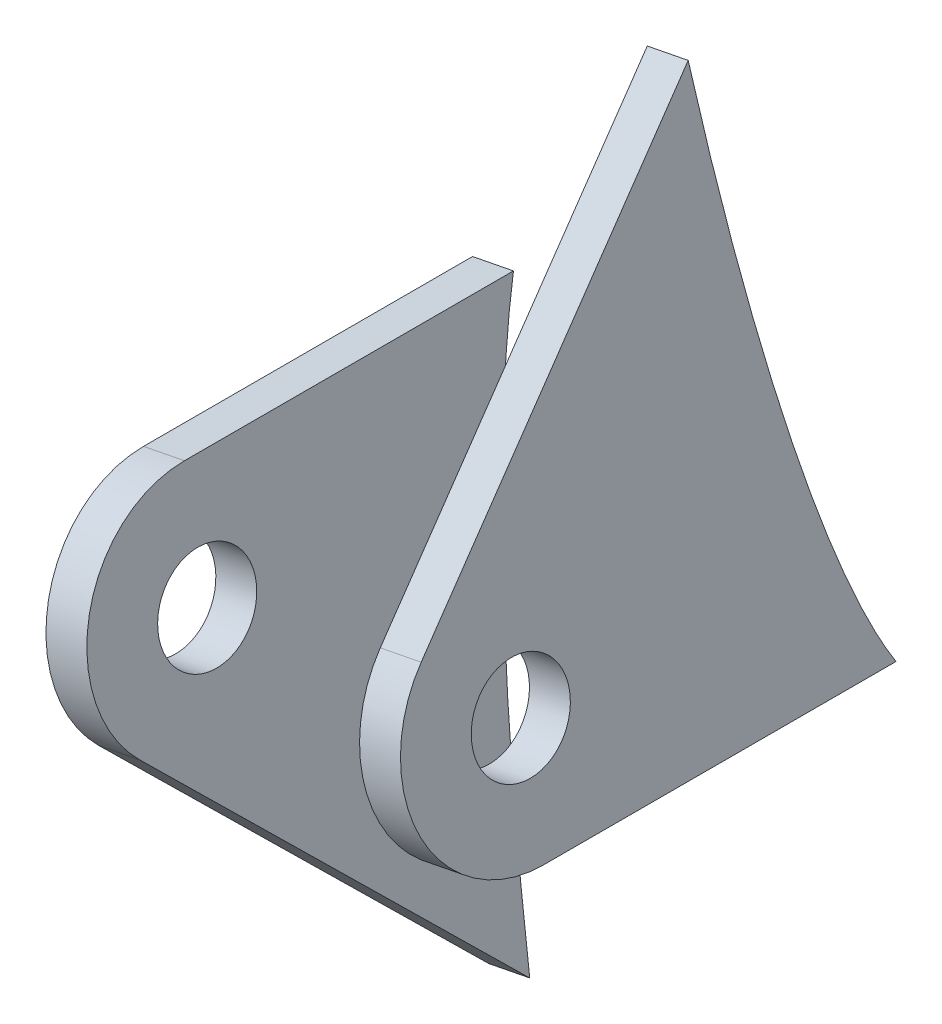
ISO-10303-21;
HEADER;
FILE_DESCRIPTION(('STEP AP214'),'2;1');
FILE_NAME('part.step','',(''),(''),'','','');
FILE_SCHEMA(('AUTOMOTIVE_DESIGN { 1 0 10303 214 1 1 1 1 }'));
ENDSEC;
DATA;
#1=APPLICATION_CONTEXT('core data for automotive mechanical design processes');
#2=APPLICATION_PROTOCOL_DEFINITION('international standard','automotive_design',2000,#1);
#3=PRODUCT_CONTEXT('',#1,'mechanical');
#4=PRODUCT('Part','Part','',(#3));
#5=PRODUCT_RELATED_PRODUCT_CATEGORY('part','',(#4));
#6=PRODUCT_DEFINITION_FORMATION('','',#4);
#7=PRODUCT_DEFINITION_CONTEXT('part definition',#1,'design');
#8=PRODUCT_DEFINITION('design','',#6,#7);
#9=PRODUCT_DEFINITION_SHAPE('','',#8);
#10=(LENGTH_UNIT() NAMED_UNIT(*) SI_UNIT(.MILLI.,.METRE.));
#11=(NAMED_UNIT(*) PLANE_ANGLE_UNIT() SI_UNIT($,.RADIAN.));
#12=(NAMED_UNIT(*) SI_UNIT($,.STERADIAN.) SOLID_ANGLE_UNIT());
#13=UNCERTAINTY_MEASURE_WITH_UNIT(LENGTH_MEASURE(1.E-05),#10,'distance_accuracy_value','');
#14=(GEOMETRIC_REPRESENTATION_CONTEXT(3) GLOBAL_UNCERTAINTY_ASSIGNED_CONTEXT((#13)) GLOBAL_UNIT_ASSIGNED_CONTEXT((#10,
#11,#12)) REPRESENTATION_CONTEXT('',''));
#15=CARTESIAN_POINT('',(0.,0.,0.));
#16=DIRECTION('',(0.,0.,1.));
#17=DIRECTION('',(1.,0.,0.));
#18=AXIS2_PLACEMENT_3D('',#15,#16,#17);
#19=CARTESIAN_POINT('',(1415.64044683684,-134.580184633639,404.672593211234));
#20=DIRECTION('',(0.135715180098194,-0.693960692822464,0.70710674350361));
#21=DIRECTION('',(0.,-0.713710064520569,-0.700441249357893));
#22=AXIS2_PLACEMENT_3D('',#19,#20,#21);
#23=PLANE('',#22);
#24=DIRECTION('',(0.136168267482668,-0.693871930706592,-0.707106743503606));
#25=VECTOR('',#24,1.);
#26=CARTESIAN_POINT('',(1418.5844842577,-134.003432775944,404.673572624839));
#27=LINE('',#26,#25);
#28=CARTESIAN_POINT('',(1411.69520051873,-98.8977455441605,440.448860654784));
#29=VERTEX_POINT('',#28);
#30=CARTESIAN_POINT('',(1416.22677221443,-121.989251808875,416.916910341118));
#31=VERTEX_POINT('',#30);
#32=EDGE_CURVE('E127',#29,#31,#27,.T.);
#33=ORIENTED_EDGE('',*,*,#32,.F.);
#34=DIRECTION('',(0.9813458069517,0.192250619231437,0.000326471201780524));
#35=VECTOR('',#34,1.);
#36=CARTESIAN_POINT('',(1408.75116309788,-99.4744974018548,440.447881241179));
#37=LINE('',#36,#35);
#38=CARTESIAN_POINT('',(1408.75116309788,-99.4744974018548,440.447881241179));
#39=VERTEX_POINT('',#38);
#40=EDGE_CURVE('E12',#39,#29,#37,.T.);
#41=ORIENTED_EDGE('',*,*,#40,.F.);
#42=DIRECTION('',(0.136168267482668,-0.693871930706592,-0.707106743503606));
#43=VECTOR('',#42,1.);
#44=CARTESIAN_POINT('',(1415.64044683684,-134.580184633639,404.672593211234));
#45=LINE('',#44,#43);
#46=CARTESIAN_POINT('',(1413.28273479358,-122.56600366657,416.915930927512));
#47=VERTEX_POINT('',#46);
#48=EDGE_CURVE('E105',#39,#47,#45,.T.);
#49=ORIENTED_EDGE('',*,*,#48,.T.);
#50=DIRECTION('',(0.9813458069517,0.192250619231437,0.000326471201780524));
#51=VECTOR('',#50,1.);
#52=CARTESIAN_POINT('',(1413.28273479358,-122.56600366657,416.915930927512));
#53=LINE('',#52,#51);
#54=EDGE_CURVE('E50',#47,#31,#53,.T.);
#55=ORIENTED_EDGE('',*,*,#54,.T.);
#56=EDGE_LOOP('',(#33,#41,#49,#55));
#57=FACE_BOUND('',#56,.T.);
#58=ADVANCED_FACE('F46',(#57),#23,.T.);
#59=CARTESIAN_POINT('',(1407.59758406704,-93.5758315128638,434.437473921398));
#60=DIRECTION('',(0.9813458069517,0.192250619231437,0.000326471201780524));
#61=DIRECTION('',(-0.192250629476805,0.981345859249313,0.));
#62=AXIS2_PLACEMENT_3D('',#59,#60,#61);
#63=CYLINDRICAL_SURFACE('',#62,8.50000000000007);
#64=CARTESIAN_POINT('',(1410.5416214879,-92.9990796551694,434.438453335004));
#65=DIRECTION('',(0.9813458069517,0.192250619231437,0.000326471201780365));
#66=DIRECTION('',(-0.192250629476804,0.981345859249313,0.));
#67=AXIS2_PLACEMENT_3D('',#64,#65,#66);
#68=CIRCLE('',#67,8.50000000000007);
#69=CARTESIAN_POINT('',(1408.90749113735,-84.6576398515503,434.438453335004));
#70=VERTEX_POINT('',#69);
#71=EDGE_CURVE('E133',#70,#29,#68,.T.);
#72=ORIENTED_EDGE('',*,*,#71,.F.);
#73=DIRECTION('',(0.9813458069517,0.192250619231437,0.000326471201780524));
#74=VECTOR('',#73,1.);
#75=CARTESIAN_POINT('',(1405.96345371649,-85.2343917092446,434.437473921398));
#76=LINE('',#75,#74);
#77=CARTESIAN_POINT('',(1405.96345371649,-85.2343917092446,434.437473921398));
#78=VERTEX_POINT('',#77);
#79=EDGE_CURVE('E56',#78,#70,#76,.T.);
#80=ORIENTED_EDGE('',*,*,#79,.F.);
#81=CARTESIAN_POINT('',(1407.59758406704,-93.5758315128638,434.437473921398));
#82=DIRECTION('',(0.9813458069517,0.192250619231437,0.000326471201780365));
#83=DIRECTION('',(-0.192250629476804,0.981345859249313,0.));
#84=AXIS2_PLACEMENT_3D('',#81,#82,#83);
#85=CIRCLE('',#84,8.50000000000007);
#86=EDGE_CURVE('E98',#78,#39,#85,.T.);
#87=ORIENTED_EDGE('',*,*,#86,.T.);
#88=ORIENTED_EDGE('',*,*,#40,.T.);
#89=EDGE_LOOP('',(#72,#80,#87,#88));
#90=FACE_BOUND('',#89,.T.);
#91=ADVANCED_FACE('F122',(#90),#63,.T.);
#92=CARTESIAN_POINT('',(1406.1024966919,-85.2071524853947,0.445140808783872));
#93=DIRECTION('',(0.192250629476805,-0.981345859249313,0.));
#94=DIRECTION('',(0.981345859249313,0.192250629476805,0.));
#95=AXIS2_PLACEMENT_3D('',#92,#93,#94);
#96=PLANE('',#95);
#97=DIRECTION('',(0.000320381162036681,6.27642940208991E-05,-0.999999946708276));
#98=VECTOR('',#97,1.);
#99=CARTESIAN_POINT('',(1409.04653411275,-84.6304006277004,0.446120222389214));
#100=LINE('',#99,#98);
#101=CARTESIAN_POINT('',(1408.91507180398,-84.6561547605223,410.777055209102));
#102=VERTEX_POINT('',#101);
#103=EDGE_CURVE('E102',#70,#102,#100,.T.);
#104=ORIENTED_EDGE('',*,*,#103,.T.);
#105=DIRECTION('',(0.9813458069517,0.192250619231437,0.000326471201780524));
#106=VECTOR('',#105,1.);
#107=CARTESIAN_POINT('',(1405.97103438312,-85.2329066182166,410.776075795496));
#108=LINE('',#107,#106);
#109=CARTESIAN_POINT('',(1405.97103438312,-85.2329066182166,410.776075795496));
#110=VERTEX_POINT('',#109);
#111=EDGE_CURVE('E100',#110,#102,#108,.T.);
#112=ORIENTED_EDGE('',*,*,#111,.F.);
#113=DIRECTION('',(0.000320381162036681,6.27642940208991E-05,-0.999999946708276));
#114=VECTOR('',#113,1.);
#115=CARTESIAN_POINT('',(1406.1024966919,-85.2071524853947,0.445140808783872));
#116=LINE('',#115,#114);
#117=EDGE_CURVE('E94',#78,#110,#116,.T.);
#118=ORIENTED_EDGE('',*,*,#117,.F.);
#119=ORIENTED_EDGE('',*,*,#79,.T.);
#120=EDGE_LOOP('',(#104,#112,#118,#119));
#121=FACE_BOUND('',#120,.T.);
#122=ADVANCED_FACE('F101',(#121),#96,.F.);
#123=CARTESIAN_POINT('',(1407.59758406704,-93.5758315128638,434.437473921398));
#124=DIRECTION('',(0.9813458069517,0.192250619231437,0.000326471201780524));
#125=DIRECTION('',(-0.192250629476805,0.981345859249313,0.));
#126=AXIS2_PLACEMENT_3D('',#123,#124,#125);
#127=CYLINDRICAL_SURFACE('',#126,3.50000000000004);
#128=CARTESIAN_POINT('',(1407.59758406704,-93.5758315128638,434.437473921398));
#129=DIRECTION('',(0.9813458069517,0.192250619231437,0.000326471201780365));
#130=DIRECTION('',(-0.192250629476804,0.981345859249313,0.));
#131=AXIS2_PLACEMENT_3D('',#128,#129,#130);
#132=CIRCLE('',#131,3.50000000000004);
#133=CARTESIAN_POINT('',(1406.92470686387,-90.1411210054912,434.437473921398));
#134=VERTEX_POINT('',#133);
#135=EDGE_CURVE('E107',#134,#134,#132,.T.);
#136=ORIENTED_EDGE('',*,*,#135,.F.);
#137=EDGE_LOOP('',(#136));
#138=FACE_BOUND('',#137,.T.);
#139=CARTESIAN_POINT('',(1410.5416214879,-92.9990796551695,434.438453335004));
#140=DIRECTION('',(0.9813458069517,0.192250619231437,0.000326471201780365));
#141=DIRECTION('',(-0.192250629476804,0.981345859249313,0.));
#142=AXIS2_PLACEMENT_3D('',#139,#140,#141);
#143=CIRCLE('',#142,3.50000000000004);
#144=CARTESIAN_POINT('',(1409.86874428473,-89.5643691477968,434.438453335004));
#145=VERTEX_POINT('',#144);
#146=EDGE_CURVE('E131',#145,#145,#143,.T.);
#147=ORIENTED_EDGE('',*,*,#146,.T.);
#148=EDGE_LOOP('',(#147));
#149=FACE_BOUND('',#148,.T.);
#150=ADVANCED_FACE('F48',(#138,#149),#127,.F.);
#151=CARTESIAN_POINT('',(1425.7167484133,-186.030658578238,414.012387811522));
#152=CARTESIAN_POINT('',(1416.42904857337,-138.636627936667,422.936775024015));
#153=CARTESIAN_POINT('',(1404.5750736221,-78.1193007199018,417.897992106518));
#154=CARTESIAN_POINT('',(1404.55597631837,-77.9999453118086,405.017553809317));
#155=CARTESIAN_POINT('',(1404.53687901463,-77.8805899037155,392.137115512117));
#156=CARTESIAN_POINT('',(1416.37586028382,-138.304208758882,387.063204008862));
#157=CARTESIAN_POINT('',(1425.68998288606,-185.863377873552,395.960011053274));
#158=(BOUNDED_CURVE() B_SPLINE_CURVE(3,(#151,#152,#153,#154,#155,#156,#157),.UNSPECIFIED.,.F.,
.F.) B_SPLINE_CURVE_WITH_KNOTS((4,3,4),(0.,0.5,1.),
.UNSPECIFIED.) CURVE() GEOMETRIC_REPRESENTATION_ITEM() RATIONAL_B_SPLINE_CURVE((1.,
0.595040121757073,0.595040121757073,1.,0.595040121757073,0.595040121757073,1.)) REPRESENTATION_ITEM(''));
#159=DIRECTION('',(0.9813458069517,0.192250619231437,0.000326471201780524));
#160=VECTOR('',#159,1.);
#161=SURFACE_OF_LINEAR_EXTRUSION('',#158,#160);
#162=CARTESIAN_POINT('',(1428.66078583415,-185.453906720544,414.013367225127));
#163=CARTESIAN_POINT('',(1419.37308599423,-138.059876078973,422.93775443762));
#164=CARTESIAN_POINT('',(1407.51911104296,-77.5425488622075,417.898971520123));
#165=CARTESIAN_POINT('',(1407.50001373922,-77.4231934541143,405.018533222923));
#166=CARTESIAN_POINT('',(1407.48091643549,-77.3038380460212,392.138094925722));
#167=CARTESIAN_POINT('',(1419.31989770467,-137.727456901187,387.064183422467));
#168=CARTESIAN_POINT('',(1428.63402030691,-185.286626015857,395.960990466879));
#169=(BOUNDED_CURVE() B_SPLINE_CURVE(3,(#162,#163,#164,#165,#166,#167,#168),.UNSPECIFIED.,.F.,
.F.) B_SPLINE_CURVE_WITH_KNOTS((4,3,4),(0.,0.5,1.),
.UNSPECIFIED.) CURVE() GEOMETRIC_REPRESENTATION_ITEM() RATIONAL_B_SPLINE_CURVE((1.,
0.595040121757073,0.595040121757073,1.,0.595040121757073,0.595040121757073,1.)) REPRESENTATION_ITEM(''));
#170=EDGE_CURVE('E130',#31,#102,#169,.T.);
#171=ORIENTED_EDGE('',*,*,#170,.F.);
#172=ORIENTED_EDGE('',*,*,#54,.F.);
#173=EDGE_CURVE('E97',#47,#110,#158,.T.);
#174=ORIENTED_EDGE('',*,*,#173,.T.);
#175=ORIENTED_EDGE('',*,*,#111,.T.);
#176=EDGE_LOOP('',(#171,#172,#174,#175));
#177=FACE_BOUND('',#176,.T.);
#178=ADVANCED_FACE('F104',(#177),#161,.T.);
#179=CARTESIAN_POINT('',(1338.05696738703,262.132144168581,0.445140808773981));
#180=DIRECTION('',(0.9813458069517,0.192250619231437,0.000326471201780365));
#181=DIRECTION('',(-0.192250629476804,0.981345859249313,0.));
#182=AXIS2_PLACEMENT_3D('',#179,#180,#181);
#183=PLANE('',#182);
#184=ORIENTED_EDGE('',*,*,#135,.T.);
#185=EDGE_LOOP('',(#184));
#186=FACE_BOUND('',#185,.T.);
#187=ORIENTED_EDGE('',*,*,#48,.F.);
#188=ORIENTED_EDGE('',*,*,#86,.F.);
#189=ORIENTED_EDGE('',*,*,#117,.T.);
#190=ORIENTED_EDGE('',*,*,#173,.F.);
#191=EDGE_LOOP('',(#187,#188,#189,#190));
#192=FACE_BOUND('',#191,.T.);
#193=ADVANCED_FACE('F96',(#186,#192),#183,.F.);
#194=CARTESIAN_POINT('',(1341.00100480789,262.708896026275,0.446120222379323));
#195=DIRECTION('',(0.9813458069517,0.192250619231437,0.000326471201780365));
#196=DIRECTION('',(-0.192250629476804,0.981345859249313,0.));
#197=AXIS2_PLACEMENT_3D('',#194,#195,#196);
#198=PLANE('',#197);
#199=ORIENTED_EDGE('',*,*,#146,.F.);
#200=EDGE_LOOP('',(#199));
#201=FACE_BOUND('',#200,.T.);
#202=ORIENTED_EDGE('',*,*,#32,.T.);
#203=ORIENTED_EDGE('',*,*,#170,.T.);
#204=ORIENTED_EDGE('',*,*,#103,.F.);
#205=ORIENTED_EDGE('',*,*,#71,.T.);
#206=EDGE_LOOP('',(#202,#203,#204,#205));
#207=FACE_BOUND('',#206,.T.);
#208=ADVANCED_FACE('F134',(#201,#207),#198,.T.);
#209=CLOSED_SHELL('',(#58,#91,#122,#150,#178,#193,#208));
#210=MANIFOLD_SOLID_BREP('B2',#209);
#211=CARTESIAN_POINT('',(1355.52524435521,308.134258911394,42.2393244097397));
#212=DIRECTION('',(-0.136168267482673,0.693871930706592,0.707106743503605));
#213=DIRECTION('',(0.,-0.713754853495984,0.700395609003174));
#214=AXIS2_PLACEMENT_3D('',#211,#212,#213);
#215=PLANE('',#214);
#216=DIRECTION('',(-0.1357151800982,0.693960692822463,-0.70710674350361));
#217=VECTOR('',#216,1.);
#218=CARTESIAN_POINT('',(1352.58120693435,307.5575070537,42.2383449961344));
#219=LINE('',#218,#217);
#220=CARTESIAN_POINT('',(1429.01110735333,-83.2561558595338,440.45539007882));
#221=VERTEX_POINT('',#220);
#222=CARTESIAN_POINT('',(1424.44822645302,-59.9244991608973,416.681749929813));
#223=VERTEX_POINT('',#222);
#224=EDGE_CURVE('E282',#221,#223,#219,.T.);
#225=ORIENTED_EDGE('',*,*,#224,.F.);
#226=DIRECTION('',(-0.9813458069517,-0.192250619231438,-0.000326471201787507));
#227=VECTOR('',#226,1.);
#228=CARTESIAN_POINT('',(1431.95514477419,-82.6794040018395,440.456369492425));
#229=LINE('',#228,#227);
#230=CARTESIAN_POINT('',(1431.95514477419,-82.6794040018395,440.456369492425));
#231=VERTEX_POINT('',#230);
#232=EDGE_CURVE('E44',#231,#221,#229,.T.);
#233=ORIENTED_EDGE('',*,*,#232,.F.);
#234=DIRECTION('',(-0.1357151800982,0.693960692822463,-0.70710674350361));
#235=VECTOR('',#234,1.);
#236=CARTESIAN_POINT('',(1355.52524435521,308.134258911394,42.2393244097397));
#237=LINE('',#236,#235);
#238=CARTESIAN_POINT('',(1427.39226387388,-59.347747303203,416.682729343418));
#239=VERTEX_POINT('',#238);
#240=EDGE_CURVE('E260',#231,#239,#237,.T.);
#241=ORIENTED_EDGE('',*,*,#240,.T.);
#242=DIRECTION('',(-0.9813458069517,-0.192250619231438,-0.000326471201787507));
#243=VECTOR('',#242,1.);
#244=CARTESIAN_POINT('',(1427.39226387388,-59.347747303203,416.682729343418));
#245=LINE('',#244,#243);
#246=EDGE_CURVE('E205',#239,#223,#245,.T.);
#247=ORIENTED_EDGE('',*,*,#246,.T.);
#248=EDGE_LOOP('',(#225,#233,#241,#247));
#249=FACE_BOUND('',#248,.T.);
#250=ADVANCED_FACE('F201',(#249),#215,.T.);
#251=CARTESIAN_POINT('',(1433.11257504779,-88.5773154128456,434.445962172645));
#252=DIRECTION('',(-0.9813458069517,-0.192250619231438,-0.000326471201787507));
#253=DIRECTION('',(0.192250629476805,-0.981345859249313,0.));
#254=AXIS2_PLACEMENT_3D('',#251,#252,#253);
#255=CYLINDRICAL_SURFACE('',#254,8.50000000000002);
#256=CARTESIAN_POINT('',(1430.16853762694,-89.1540672705399,434.444982759039));
#257=DIRECTION('',(-0.9813458069517,-0.192250619231439,-0.000326471201773842));
#258=DIRECTION('',(0.192250629476807,-0.981345859249313,0.));
#259=AXIS2_PLACEMENT_3D('',#256,#257,#258);
#260=CIRCLE('',#259,8.50000000000002);
#261=CARTESIAN_POINT('',(1431.80266797749,-97.4955070741591,434.444982759039));
#262=VERTEX_POINT('',#261);
#263=EDGE_CURVE('E288',#262,#221,#260,.T.);
#264=ORIENTED_EDGE('',*,*,#263,.F.);
#265=DIRECTION('',(-0.9813458069517,-0.192250619231438,-0.000326471201787507));
#266=VECTOR('',#265,1.);
#267=CARTESIAN_POINT('',(1434.74670539834,-96.9187552164647,434.445962172645));
#268=LINE('',#267,#266);
#269=CARTESIAN_POINT('',(1434.74670539834,-96.9187552164647,434.445962172645));
#270=VERTEX_POINT('',#269);
#271=EDGE_CURVE('E211',#270,#262,#268,.T.);
#272=ORIENTED_EDGE('',*,*,#271,.F.);
#273=CARTESIAN_POINT('',(1433.11257504779,-88.5773154128456,434.445962172645));
#274=DIRECTION('',(-0.9813458069517,-0.192250619231439,-0.000326471201773842));
#275=DIRECTION('',(0.192250629476807,-0.981345859249313,0.));
#276=AXIS2_PLACEMENT_3D('',#273,#274,#275);
#277=CIRCLE('',#276,8.50000000000002);
#278=EDGE_CURVE('E253',#270,#231,#277,.T.);
#279=ORIENTED_EDGE('',*,*,#278,.T.);
#280=ORIENTED_EDGE('',*,*,#232,.T.);
#281=EDGE_LOOP('',(#264,#272,#279,#280));
#282=FACE_BOUND('',#281,.T.);
#283=ADVANCED_FACE('F277',(#282),#255,.T.);
#284=CARTESIAN_POINT('',(1434.88574837375,-96.8915159926043,0.453629060011967));
#285=DIRECTION('',(-0.192250629476805,0.981345859249313,0.));
#286=DIRECTION('',(-0.981345859249313,-0.192250629476805,0.));
#287=AXIS2_PLACEMENT_3D('',#284,#285,#286);
#288=PLANE('',#287);
#289=DIRECTION('',(0.000320381162025279,6.27642940451702E-05,-0.999999946708276));
#290=VECTOR('',#289,1.);
#291=CARTESIAN_POINT('',(1431.94171095289,-97.4682678502986,0.452649646406605));
#292=LINE('',#291,#290);
#293=CARTESIAN_POINT('',(1431.81079017439,-97.493915894604,409.093315948789));
#294=VERTEX_POINT('',#293);
#295=EDGE_CURVE('E257',#262,#294,#292,.T.);
#296=ORIENTED_EDGE('',*,*,#295,.T.);
#297=DIRECTION('',(-0.9813458069517,-0.192250619231438,-0.000326471201787507));
#298=VECTOR('',#297,1.);
#299=CARTESIAN_POINT('',(1434.75482759525,-96.9171640369097,409.094295362394));
#300=LINE('',#299,#298);
#301=CARTESIAN_POINT('',(1434.75482759525,-96.9171640369097,409.094295362394));
#302=VERTEX_POINT('',#301);
#303=EDGE_CURVE('E255',#302,#294,#300,.T.);
#304=ORIENTED_EDGE('',*,*,#303,.F.);
#305=DIRECTION('',(0.000320381162025279,6.27642940451702E-05,-0.999999946708276));
#306=VECTOR('',#305,1.);
#307=CARTESIAN_POINT('',(1434.88574837375,-96.8915159926043,0.453629060011967));
#308=LINE('',#307,#306);
#309=EDGE_CURVE('E249',#270,#302,#308,.T.);
#310=ORIENTED_EDGE('',*,*,#309,.F.);
#311=ORIENTED_EDGE('',*,*,#271,.T.);
#312=EDGE_LOOP('',(#296,#304,#310,#311));
#313=FACE_BOUND('',#312,.T.);
#314=ADVANCED_FACE('F256',(#313),#288,.F.);
#315=CARTESIAN_POINT('',(1433.11257504779,-88.5773154128456,434.445962172645));
#316=DIRECTION('',(-0.9813458069517,-0.192250619231438,-0.000326471201787507));
#317=DIRECTION('',(0.192250629476805,-0.981345859249313,0.));
#318=AXIS2_PLACEMENT_3D('',#315,#316,#317);
#319=CYLINDRICAL_SURFACE('',#318,3.50000000000001);
#320=CARTESIAN_POINT('',(1433.11257504779,-88.5773154128456,434.445962172645));
#321=DIRECTION('',(-0.9813458069517,-0.192250619231439,-0.000326471201773842));
#322=DIRECTION('',(0.192250629476807,-0.981345859249313,0.));
#323=AXIS2_PLACEMENT_3D('',#320,#321,#322);
#324=CIRCLE('',#323,3.50000000000001);
#325=CARTESIAN_POINT('',(1433.78545225096,-92.0120259202182,434.445962172645));
#326=VERTEX_POINT('',#325);
#327=EDGE_CURVE('E262',#326,#326,#324,.T.);
#328=ORIENTED_EDGE('',*,*,#327,.F.);
#329=EDGE_LOOP('',(#328));
#330=FACE_BOUND('',#329,.T.);
#331=CARTESIAN_POINT('',(1430.16853762694,-89.1540672705399,434.444982759039));
#332=DIRECTION('',(-0.9813458069517,-0.192250619231439,-0.000326471201773842));
#333=DIRECTION('',(0.192250629476807,-0.981345859249313,0.));
#334=AXIS2_PLACEMENT_3D('',#331,#332,#333);
#335=CIRCLE('',#334,3.50000000000001);
#336=CARTESIAN_POINT('',(1430.84141483011,-92.5887777779125,434.444982759039));
#337=VERTEX_POINT('',#336);
#338=EDGE_CURVE('E286',#337,#337,#335,.T.);
#339=ORIENTED_EDGE('',*,*,#338,.T.);
#340=EDGE_LOOP('',(#339));
#341=FACE_BOUND('',#340,.T.);
#342=ADVANCED_FACE('F203',(#330,#341),#319,.F.);
#343=CARTESIAN_POINT('',(1410.44403811257,27.1845378212384,404.996820951045));
#344=CARTESIAN_POINT('',(1410.43572118745,27.1845378212384,429.996819567621));
#345=CARTESIAN_POINT('',(1435.43571980403,-100.428297078801,430.00513649274));
#346=CARTESIAN_POINT('',(1435.44403672915,-100.428297078801,405.005137876165));
#347=CARTESIAN_POINT('',(1435.45235365427,-100.428297078801,380.00513925959));
#348=CARTESIAN_POINT('',(1410.45235503769,27.1845378212384,379.99682233447));
#349=CARTESIAN_POINT('',(1410.44403811257,27.1845378212384,404.996820951045));
#350=(BOUNDED_CURVE() B_SPLINE_CURVE(3,(#343,#344,#345,#346,#347,#348,#349),.UNSPECIFIED.,.T.,
.F.) B_SPLINE_CURVE_WITH_KNOTS((4,3,4),(0.,0.5,1.),
.UNSPECIFIED.) CURVE() GEOMETRIC_REPRESENTATION_ITEM() RATIONAL_B_SPLINE_CURVE((1.,
0.333333333333333,0.333333333333333,1.,0.333333333333333,0.333333333333333,1.)) REPRESENTATION_ITEM(''));
#351=DIRECTION('',(-0.9813458069517,-0.192250619231438,-0.000326471201787507));
#352=VECTOR('',#351,1.);
#353=SURFACE_OF_LINEAR_EXTRUSION('',#350,#352);
#354=CARTESIAN_POINT('',(1407.50000069172,26.6077859635441,404.99584153744));
#355=CARTESIAN_POINT('',(1407.4916837666,26.6077859635441,429.995840154015));
#356=CARTESIAN_POINT('',(1432.49168238318,-101.005048936495,430.004157079135));
#357=CARTESIAN_POINT('',(1432.4999993083,-101.005048936495,405.00415846256));
#358=CARTESIAN_POINT('',(1432.50831623342,-101.005048936495,380.004159845985));
#359=CARTESIAN_POINT('',(1407.50831761684,26.6077859635441,379.995842920865));
#360=CARTESIAN_POINT('',(1407.50000069172,26.6077859635441,404.99584153744));
#361=(BOUNDED_CURVE() B_SPLINE_CURVE(3,(#354,#355,#356,#357,#358,#359,#360),.UNSPECIFIED.,.T.,
.F.) B_SPLINE_CURVE_WITH_KNOTS((4,3,4),(0.,0.5,1.),
.UNSPECIFIED.) CURVE() GEOMETRIC_REPRESENTATION_ITEM() RATIONAL_B_SPLINE_CURVE((1.,
0.333333333333333,0.333333333333333,1.,0.333333333333333,0.333333333333333,1.)) REPRESENTATION_ITEM(''));
#362=EDGE_CURVE('E285',#223,#294,#361,.T.);
#363=ORIENTED_EDGE('',*,*,#362,.F.);
#364=ORIENTED_EDGE('',*,*,#246,.F.);
#365=EDGE_CURVE('E252',#239,#302,#350,.T.);
#366=ORIENTED_EDGE('',*,*,#365,.T.);
#367=ORIENTED_EDGE('',*,*,#303,.T.);
#368=EDGE_LOOP('',(#363,#364,#366,#367));
#369=FACE_BOUND('',#368,.T.);
#370=ADVANCED_FACE('F259',(#369),#353,.T.);
#371=CARTESIAN_POINT('',(1363.57195836778,267.130660268602,0.453629060011249));
#372=DIRECTION('',(-0.9813458069517,-0.192250619231439,-0.000326471201773842));
#373=DIRECTION('',(0.192250629476807,-0.981345859249313,0.));
#374=AXIS2_PLACEMENT_3D('',#371,#372,#373);
#375=PLANE('',#374);
#376=ORIENTED_EDGE('',*,*,#327,.T.);
#377=EDGE_LOOP('',(#376));
#378=FACE_BOUND('',#377,.T.);
#379=ORIENTED_EDGE('',*,*,#240,.F.);
#380=ORIENTED_EDGE('',*,*,#278,.F.);
#381=ORIENTED_EDGE('',*,*,#309,.T.);
#382=ORIENTED_EDGE('',*,*,#365,.F.);
#383=EDGE_LOOP('',(#379,#380,#381,#382));
#384=FACE_BOUND('',#383,.T.);
#385=ADVANCED_FACE('F251',(#378,#384),#375,.F.);
#386=CARTESIAN_POINT('',(1360.62792094692,266.553908410908,0.452649646405886));
#387=DIRECTION('',(-0.9813458069517,-0.192250619231439,-0.000326471201773842));
#388=DIRECTION('',(0.192250629476807,-0.981345859249313,0.));
#389=AXIS2_PLACEMENT_3D('',#386,#387,#388);
#390=PLANE('',#389);
#391=ORIENTED_EDGE('',*,*,#338,.F.);
#392=EDGE_LOOP('',(#391));
#393=FACE_BOUND('',#392,.T.);
#394=ORIENTED_EDGE('',*,*,#224,.T.);
#395=ORIENTED_EDGE('',*,*,#362,.T.);
#396=ORIENTED_EDGE('',*,*,#295,.F.);
#397=ORIENTED_EDGE('',*,*,#263,.T.);
#398=EDGE_LOOP('',(#394,#395,#396,#397));
#399=FACE_BOUND('',#398,.T.);
#400=ADVANCED_FACE('F289',(#393,#399),#390,.T.);
#401=CLOSED_SHELL('',(#250,#283,#314,#342,#370,#385,#400));
#402=MANIFOLD_SOLID_BREP('B6',#401);
#403=ADVANCED_BREP_SHAPE_REPRESENTATION('',(#18,#210,#402),#14);
#404=SHAPE_DEFINITION_REPRESENTATION(#9,#403);
ENDSEC;
END-ISO-10303-21;
